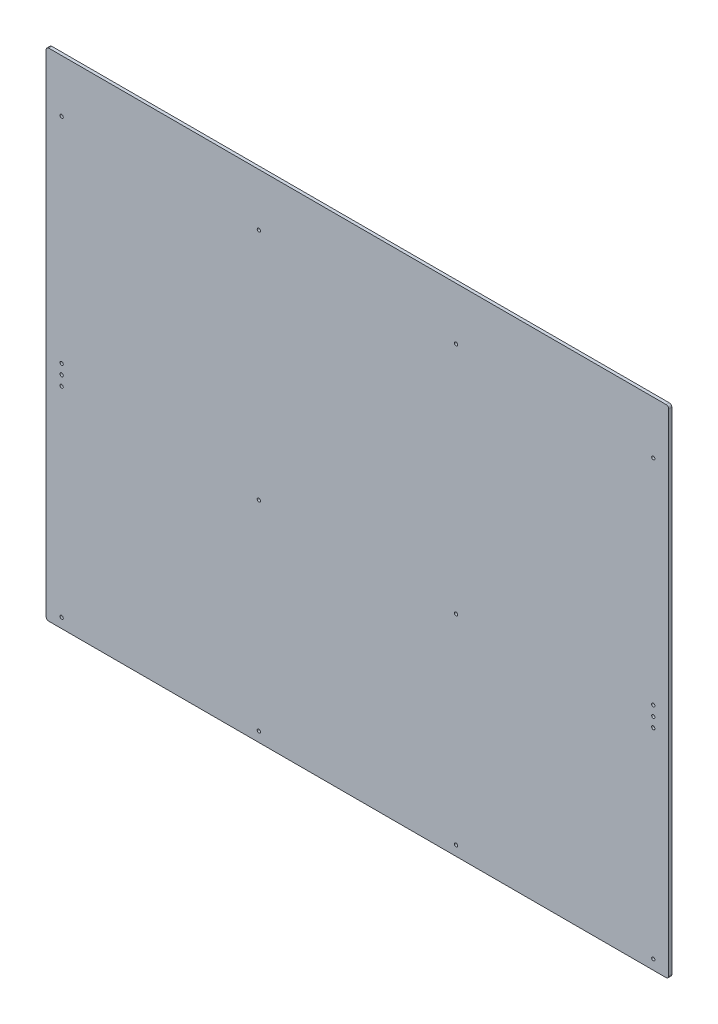
ISO-10303-21;
HEADER;
FILE_DESCRIPTION(('STEP AP214'),'2;1');
FILE_NAME('part.step','',(''),(''),'','','');
FILE_SCHEMA(('AUTOMOTIVE_DESIGN { 1 0 10303 214 1 1 1 1 }'));
ENDSEC;
DATA;
#1=APPLICATION_CONTEXT('core data for automotive mechanical design processes');
#2=APPLICATION_PROTOCOL_DEFINITION('international standard','automotive_design',2000,#1);
#3=PRODUCT_CONTEXT('',#1,'mechanical');
#4=PRODUCT('Part','Part','',(#3));
#5=PRODUCT_RELATED_PRODUCT_CATEGORY('part','',(#4));
#6=PRODUCT_DEFINITION_FORMATION('','',#4);
#7=PRODUCT_DEFINITION_CONTEXT('part definition',#1,'design');
#8=PRODUCT_DEFINITION('design','',#6,#7);
#9=PRODUCT_DEFINITION_SHAPE('','',#8);
#10=(LENGTH_UNIT() NAMED_UNIT(*) SI_UNIT(.MILLI.,.METRE.));
#11=(NAMED_UNIT(*) PLANE_ANGLE_UNIT() SI_UNIT($,.RADIAN.));
#12=(NAMED_UNIT(*) SI_UNIT($,.STERADIAN.) SOLID_ANGLE_UNIT());
#13=UNCERTAINTY_MEASURE_WITH_UNIT(LENGTH_MEASURE(1.E-05),#10,'distance_accuracy_value','');
#14=(GEOMETRIC_REPRESENTATION_CONTEXT(3) GLOBAL_UNCERTAINTY_ASSIGNED_CONTEXT((#13)) GLOBAL_UNIT_ASSIGNED_CONTEXT((#10,
#11,#12)) REPRESENTATION_CONTEXT('',''));
#15=CARTESIAN_POINT('',(0.,0.,0.));
#16=DIRECTION('',(0.,0.,1.));
#17=DIRECTION('',(1.,0.,0.));
#18=AXIS2_PLACEMENT_3D('',#15,#16,#17);
#19=CARTESIAN_POINT('',(0.,0.,3.));
#20=DIRECTION('',(0.,0.,1.));
#21=DIRECTION('',(1.,0.,0.));
#22=AXIS2_PLACEMENT_3D('',#19,#20,#21);
#23=PLANE('',#22);
#24=CARTESIAN_POINT('',(285.75,254.,3.));
#25=DIRECTION('',(0.,0.,1.));
#26=DIRECTION('',(1.,0.,0.));
#27=AXIS2_PLACEMENT_3D('',#24,#25,#26);
#28=CIRCLE('',#27,1.58750000000002);
#29=CARTESIAN_POINT('',(287.3375,254.,3.));
#30=VERTEX_POINT('',#29);
#31=EDGE_CURVE('E89',#30,#30,#28,.F.);
#32=ORIENTED_EDGE('',*,*,#31,.T.);
#33=EDGE_LOOP('',(#32));
#34=FACE_BOUND('',#33,.T.);
#35=CARTESIAN_POINT('',(285.75,-165.1,3.));
#36=DIRECTION('',(0.,0.,1.));
#37=DIRECTION('',(1.,0.,0.));
#38=AXIS2_PLACEMENT_3D('',#35,#36,#37);
#39=CIRCLE('',#38,1.58750000000002);
#40=CARTESIAN_POINT('',(287.3375,-165.1,3.));
#41=VERTEX_POINT('',#40);
#42=EDGE_CURVE('E184',#41,#41,#39,.F.);
#43=ORIENTED_EDGE('',*,*,#42,.T.);
#44=EDGE_LOOP('',(#43));
#45=FACE_BOUND('',#44,.T.);
#46=CARTESIAN_POINT('',(95.25,-165.1,3.));
#47=DIRECTION('',(0.,0.,1.));
#48=DIRECTION('',(1.,0.,0.));
#49=AXIS2_PLACEMENT_3D('',#46,#47,#48);
#50=CIRCLE('',#49,1.58749999999999);
#51=CARTESIAN_POINT('',(96.8375,-165.1,3.));
#52=VERTEX_POINT('',#51);
#53=EDGE_CURVE('E187',#52,#52,#50,.F.);
#54=ORIENTED_EDGE('',*,*,#53,.T.);
#55=EDGE_LOOP('',(#54));
#56=FACE_BOUND('',#55,.T.);
#57=CARTESIAN_POINT('',(-95.25,-165.1,3.));
#58=DIRECTION('',(0.,0.,1.));
#59=DIRECTION('',(1.,0.,0.));
#60=AXIS2_PLACEMENT_3D('',#57,#58,#59);
#61=CIRCLE('',#60,1.58749999999999);
#62=CARTESIAN_POINT('',(-93.6625,-165.1,3.));
#63=VERTEX_POINT('',#62);
#64=EDGE_CURVE('E190',#63,#63,#61,.F.);
#65=ORIENTED_EDGE('',*,*,#64,.T.);
#66=EDGE_LOOP('',(#65));
#67=FACE_BOUND('',#66,.T.);
#68=CARTESIAN_POINT('',(-285.75,-165.1,3.));
#69=DIRECTION('',(0.,0.,1.));
#70=DIRECTION('',(1.,0.,0.));
#71=AXIS2_PLACEMENT_3D('',#68,#69,#70);
#72=CIRCLE('',#71,1.58750000000002);
#73=CARTESIAN_POINT('',(-284.1625,-165.1,3.));
#74=VERTEX_POINT('',#73);
#75=EDGE_CURVE('E193',#74,#74,#72,.F.);
#76=ORIENTED_EDGE('',*,*,#75,.T.);
#77=EDGE_LOOP('',(#76));
#78=FACE_BOUND('',#77,.T.);
#79=CARTESIAN_POINT('',(95.25,254.,3.));
#80=DIRECTION('',(0.,0.,1.));
#81=DIRECTION('',(1.,0.,0.));
#82=AXIS2_PLACEMENT_3D('',#79,#80,#81);
#83=CIRCLE('',#82,1.58749999999999);
#84=CARTESIAN_POINT('',(96.8375,254.,3.));
#85=VERTEX_POINT('',#84);
#86=EDGE_CURVE('E196',#85,#85,#83,.F.);
#87=ORIENTED_EDGE('',*,*,#86,.T.);
#88=EDGE_LOOP('',(#87));
#89=FACE_BOUND('',#88,.T.);
#90=CARTESIAN_POINT('',(-95.25,254.,3.));
#91=DIRECTION('',(0.,0.,1.));
#92=DIRECTION('',(1.,0.,0.));
#93=AXIS2_PLACEMENT_3D('',#90,#91,#92);
#94=CIRCLE('',#93,1.58749999999999);
#95=CARTESIAN_POINT('',(-93.6625,254.,3.));
#96=VERTEX_POINT('',#95);
#97=EDGE_CURVE('E199',#96,#96,#94,.F.);
#98=ORIENTED_EDGE('',*,*,#97,.T.);
#99=EDGE_LOOP('',(#98));
#100=FACE_BOUND('',#99,.T.);
#101=CARTESIAN_POINT('',(-285.75,254.,3.));
#102=DIRECTION('',(0.,0.,1.));
#103=DIRECTION('',(1.,0.,0.));
#104=AXIS2_PLACEMENT_3D('',#101,#102,#103);
#105=CIRCLE('',#104,1.58750000000002);
#106=CARTESIAN_POINT('',(-284.1625,254.,3.));
#107=VERTEX_POINT('',#106);
#108=EDGE_CURVE('E202',#107,#107,#105,.F.);
#109=ORIENTED_EDGE('',*,*,#108,.T.);
#110=EDGE_LOOP('',(#109));
#111=FACE_BOUND('',#110,.T.);
#112=CARTESIAN_POINT('',(-285.75,28.2194,3.));
#113=DIRECTION('',(0.,0.,1.));
#114=DIRECTION('',(1.,0.,0.));
#115=AXIS2_PLACEMENT_3D('',#112,#113,#114);
#116=CIRCLE('',#115,1.58750000000002);
#117=CARTESIAN_POINT('',(-284.1625,28.2194,3.));
#118=VERTEX_POINT('',#117);
#119=EDGE_CURVE('E205',#118,#118,#116,.F.);
#120=ORIENTED_EDGE('',*,*,#119,.T.);
#121=EDGE_LOOP('',(#120));
#122=FACE_BOUND('',#121,.T.);
#123=CARTESIAN_POINT('',(-285.75,37.7444,3.));
#124=DIRECTION('',(0.,0.,1.));
#125=DIRECTION('',(1.,0.,0.));
#126=AXIS2_PLACEMENT_3D('',#123,#124,#125);
#127=CIRCLE('',#126,1.58750000000002);
#128=CARTESIAN_POINT('',(-284.1625,37.7444,3.));
#129=VERTEX_POINT('',#128);
#130=EDGE_CURVE('E208',#129,#129,#127,.F.);
#131=ORIENTED_EDGE('',*,*,#130,.T.);
#132=EDGE_LOOP('',(#131));
#133=FACE_BOUND('',#132,.T.);
#134=CARTESIAN_POINT('',(-285.75,47.2694,3.));
#135=DIRECTION('',(0.,0.,1.));
#136=DIRECTION('',(1.,0.,0.));
#137=AXIS2_PLACEMENT_3D('',#134,#135,#136);
#138=CIRCLE('',#137,1.58750000000002);
#139=CARTESIAN_POINT('',(-284.1625,47.2694,3.));
#140=VERTEX_POINT('',#139);
#141=EDGE_CURVE('E211',#140,#140,#138,.F.);
#142=ORIENTED_EDGE('',*,*,#141,.T.);
#143=EDGE_LOOP('',(#142));
#144=FACE_BOUND('',#143,.T.);
#145=CARTESIAN_POINT('',(-95.25,28.2194,3.));
#146=DIRECTION('',(0.,0.,1.));
#147=DIRECTION('',(1.,0.,0.));
#148=AXIS2_PLACEMENT_3D('',#145,#146,#147);
#149=CIRCLE('',#148,1.58750000000001);
#150=CARTESIAN_POINT('',(-93.6625,28.2194,3.));
#151=VERTEX_POINT('',#150);
#152=EDGE_CURVE('E214',#151,#151,#149,.F.);
#153=ORIENTED_EDGE('',*,*,#152,.T.);
#154=EDGE_LOOP('',(#153));
#155=FACE_BOUND('',#154,.T.);
#156=CARTESIAN_POINT('',(95.25,28.2194,3.));
#157=DIRECTION('',(0.,0.,1.));
#158=DIRECTION('',(1.,0.,0.));
#159=AXIS2_PLACEMENT_3D('',#156,#157,#158);
#160=CIRCLE('',#159,1.58750000000001);
#161=CARTESIAN_POINT('',(96.8375,28.2194,3.));
#162=VERTEX_POINT('',#161);
#163=EDGE_CURVE('E217',#162,#162,#160,.F.);
#164=ORIENTED_EDGE('',*,*,#163,.T.);
#165=EDGE_LOOP('',(#164));
#166=FACE_BOUND('',#165,.T.);
#167=CARTESIAN_POINT('',(285.75,28.2194,3.));
#168=DIRECTION('',(0.,0.,1.));
#169=DIRECTION('',(1.,0.,0.));
#170=AXIS2_PLACEMENT_3D('',#167,#168,#169);
#171=CIRCLE('',#170,1.58750000000002);
#172=CARTESIAN_POINT('',(287.3375,28.2194,3.));
#173=VERTEX_POINT('',#172);
#174=EDGE_CURVE('E220',#173,#173,#171,.F.);
#175=ORIENTED_EDGE('',*,*,#174,.T.);
#176=EDGE_LOOP('',(#175));
#177=FACE_BOUND('',#176,.T.);
#178=CARTESIAN_POINT('',(285.75,37.7444,3.));
#179=DIRECTION('',(0.,0.,1.));
#180=DIRECTION('',(1.,0.,0.));
#181=AXIS2_PLACEMENT_3D('',#178,#179,#180);
#182=CIRCLE('',#181,1.58749999999996);
#183=CARTESIAN_POINT('',(287.3375,37.7444,3.));
#184=VERTEX_POINT('',#183);
#185=EDGE_CURVE('E222',#184,#184,#182,.F.);
#186=ORIENTED_EDGE('',*,*,#185,.T.);
#187=EDGE_LOOP('',(#186));
#188=FACE_BOUND('',#187,.T.);
#189=CARTESIAN_POINT('',(285.75,47.2694,3.));
#190=DIRECTION('',(0.,0.,1.));
#191=DIRECTION('',(1.,0.,0.));
#192=AXIS2_PLACEMENT_3D('',#189,#190,#191);
#193=CIRCLE('',#192,1.58749999999996);
#194=CARTESIAN_POINT('',(287.3375,47.2694,3.));
#195=VERTEX_POINT('',#194);
#196=EDGE_CURVE('E19',#195,#195,#193,.F.);
#197=ORIENTED_EDGE('',*,*,#196,.T.);
#198=EDGE_LOOP('',(#197));
#199=FACE_BOUND('',#198,.T.);
#200=CARTESIAN_POINT('',(-298.1325,302.26,3.));
#201=DIRECTION('',(0.,0.,-1.));
#202=DIRECTION('',(-1.,0.,0.));
#203=AXIS2_PLACEMENT_3D('',#200,#201,#202);
#204=CIRCLE('',#203,2.53999999999999);
#205=CARTESIAN_POINT('',(-300.6725,302.26,3.));
#206=VERTEX_POINT('',#205);
#207=CARTESIAN_POINT('',(-298.1325,304.8,3.));
#208=VERTEX_POINT('',#207);
#209=EDGE_CURVE('E114',#206,#208,#204,.T.);
#210=ORIENTED_EDGE('',*,*,#209,.F.);
#211=DIRECTION('',(0.,1.,0.));
#212=VECTOR('',#211,1.);
#213=CARTESIAN_POINT('',(-300.6725,-304.8,3.));
#214=LINE('',#213,#212);
#215=CARTESIAN_POINT('',(-300.6725,-172.085,2.99999999999992));
#216=VERTEX_POINT('',#215);
#217=EDGE_CURVE('E107',#206,#216,#214,.F.);
#218=ORIENTED_EDGE('',*,*,#217,.T.);
#219=CARTESIAN_POINT('',(-298.1325,-172.085,2.99999999999989));
#220=DIRECTION('',(0.,0.,-1.));
#221=DIRECTION('',(-1.,0.,0.));
#222=AXIS2_PLACEMENT_3D('',#219,#220,#221);
#223=CIRCLE('',#222,2.53999999999999);
#224=CARTESIAN_POINT('',(-298.1325,-174.625,2.99999999999989));
#225=VERTEX_POINT('',#224);
#226=EDGE_CURVE('E110',#225,#216,#223,.T.);
#227=ORIENTED_EDGE('',*,*,#226,.F.);
#228=DIRECTION('',(1.,0.,0.));
#229=VECTOR('',#228,1.);
#230=CARTESIAN_POINT('',(-298.1325,-174.625,2.99999999999989));
#231=LINE('',#230,#229);
#232=CARTESIAN_POINT('',(298.1325,-174.625,2.99999999999989));
#233=VERTEX_POINT('',#232);
#234=EDGE_CURVE('E83',#225,#233,#231,.T.);
#235=ORIENTED_EDGE('',*,*,#234,.T.);
#236=CARTESIAN_POINT('',(298.1325,-172.085,2.99999999999989));
#237=DIRECTION('',(0.,0.,-1.));
#238=DIRECTION('',(-1.,0.,0.));
#239=AXIS2_PLACEMENT_3D('',#236,#237,#238);
#240=CIRCLE('',#239,2.53999999999999);
#241=CARTESIAN_POINT('',(300.6725,-172.085,2.99999999999989));
#242=VERTEX_POINT('',#241);
#243=EDGE_CURVE('E79',#242,#233,#240,.T.);
#244=ORIENTED_EDGE('',*,*,#243,.F.);
#245=DIRECTION('',(0.,1.,0.));
#246=VECTOR('',#245,1.);
#247=CARTESIAN_POINT('',(300.6725,-304.8,2.99999999999989));
#248=LINE('',#247,#246);
#249=CARTESIAN_POINT('',(300.6725,302.26,2.99999999999995));
#250=VERTEX_POINT('',#249);
#251=EDGE_CURVE('E81',#242,#250,#248,.T.);
#252=ORIENTED_EDGE('',*,*,#251,.T.);
#253=CARTESIAN_POINT('',(298.1325,302.26,3.));
#254=DIRECTION('',(0.,0.,-1.));
#255=DIRECTION('',(-1.,0.,0.));
#256=AXIS2_PLACEMENT_3D('',#253,#254,#255);
#257=CIRCLE('',#256,2.53999999999999);
#258=CARTESIAN_POINT('',(298.1325,304.8,3.));
#259=VERTEX_POINT('',#258);
#260=EDGE_CURVE('E96',#259,#250,#257,.T.);
#261=ORIENTED_EDGE('',*,*,#260,.F.);
#262=DIRECTION('',(1.,0.,0.));
#263=VECTOR('',#262,1.);
#264=CARTESIAN_POINT('',(300.6725,304.8,3.));
#265=LINE('',#264,#263);
#266=EDGE_CURVE('E112',#259,#208,#265,.F.);
#267=ORIENTED_EDGE('',*,*,#266,.T.);
#268=EDGE_LOOP('',(#210,#218,#227,#235,#244,#252,#261,#267));
#269=FACE_BOUND('',#268,.T.);
#270=ADVANCED_FACE('F16',(#34,#45,#56,#67,#78,#89,#100,#111,#122,#133,#144,#155,#166,#177,#188,
#199,#269),#23,.T.);
#271=CARTESIAN_POINT('',(285.75,47.2694,0.));
#272=DIRECTION('',(0.,0.,1.));
#273=DIRECTION('',(1.,0.,0.));
#274=AXIS2_PLACEMENT_3D('',#271,#272,#273);
#275=CYLINDRICAL_SURFACE('',#274,1.58749999999996);
#276=CARTESIAN_POINT('',(285.75,47.2694,0.));
#277=DIRECTION('',(0.,0.,1.));
#278=DIRECTION('',(1.,0.,0.));
#279=AXIS2_PLACEMENT_3D('',#276,#277,#278);
#280=CIRCLE('',#279,1.58749999999996);
#281=CARTESIAN_POINT('',(287.3375,47.2694,0.));
#282=VERTEX_POINT('',#281);
#283=EDGE_CURVE('E174',#282,#282,#280,.F.);
#284=ORIENTED_EDGE('',*,*,#283,.T.);
#285=EDGE_LOOP('',(#284));
#286=FACE_BOUND('',#285,.T.);
#287=ORIENTED_EDGE('',*,*,#196,.F.);
#288=EDGE_LOOP('',(#287));
#289=FACE_BOUND('',#288,.T.);
#290=ADVANCED_FACE('F230',(#286,#289),#275,.F.);
#291=CARTESIAN_POINT('',(285.75,37.7444,0.));
#292=DIRECTION('',(0.,0.,1.));
#293=DIRECTION('',(1.,0.,0.));
#294=AXIS2_PLACEMENT_3D('',#291,#292,#293);
#295=CYLINDRICAL_SURFACE('',#294,1.58749999999996);
#296=CARTESIAN_POINT('',(285.75,37.7444,0.));
#297=DIRECTION('',(0.,0.,1.));
#298=DIRECTION('',(1.,0.,0.));
#299=AXIS2_PLACEMENT_3D('',#296,#297,#298);
#300=CIRCLE('',#299,1.58749999999996);
#301=CARTESIAN_POINT('',(287.3375,37.7444,0.));
#302=VERTEX_POINT('',#301);
#303=EDGE_CURVE('E171',#302,#302,#300,.F.);
#304=ORIENTED_EDGE('',*,*,#303,.T.);
#305=EDGE_LOOP('',(#304));
#306=FACE_BOUND('',#305,.T.);
#307=ORIENTED_EDGE('',*,*,#185,.F.);
#308=EDGE_LOOP('',(#307));
#309=FACE_BOUND('',#308,.T.);
#310=ADVANCED_FACE('F232',(#306,#309),#295,.F.);
#311=CARTESIAN_POINT('',(285.75,28.2194,0.));
#312=DIRECTION('',(0.,0.,1.));
#313=DIRECTION('',(1.,0.,0.));
#314=AXIS2_PLACEMENT_3D('',#311,#312,#313);
#315=CYLINDRICAL_SURFACE('',#314,1.58750000000002);
#316=CARTESIAN_POINT('',(285.75,28.2194,0.));
#317=DIRECTION('',(0.,0.,1.));
#318=DIRECTION('',(1.,0.,0.));
#319=AXIS2_PLACEMENT_3D('',#316,#317,#318);
#320=CIRCLE('',#319,1.58750000000002);
#321=CARTESIAN_POINT('',(287.3375,28.2194,0.));
#322=VERTEX_POINT('',#321);
#323=EDGE_CURVE('E168',#322,#322,#320,.F.);
#324=ORIENTED_EDGE('',*,*,#323,.T.);
#325=EDGE_LOOP('',(#324));
#326=FACE_BOUND('',#325,.T.);
#327=ORIENTED_EDGE('',*,*,#174,.F.);
#328=EDGE_LOOP('',(#327));
#329=FACE_BOUND('',#328,.T.);
#330=ADVANCED_FACE('F239',(#326,#329),#315,.F.);
#331=CARTESIAN_POINT('',(95.25,28.2194,0.));
#332=DIRECTION('',(0.,0.,1.));
#333=DIRECTION('',(1.,0.,0.));
#334=AXIS2_PLACEMENT_3D('',#331,#332,#333);
#335=CYLINDRICAL_SURFACE('',#334,1.58750000000001);
#336=CARTESIAN_POINT('',(95.25,28.2194,0.));
#337=DIRECTION('',(0.,0.,1.));
#338=DIRECTION('',(1.,0.,0.));
#339=AXIS2_PLACEMENT_3D('',#336,#337,#338);
#340=CIRCLE('',#339,1.58750000000001);
#341=CARTESIAN_POINT('',(96.8375,28.2194,0.));
#342=VERTEX_POINT('',#341);
#343=EDGE_CURVE('E165',#342,#342,#340,.F.);
#344=ORIENTED_EDGE('',*,*,#343,.T.);
#345=EDGE_LOOP('',(#344));
#346=FACE_BOUND('',#345,.T.);
#347=ORIENTED_EDGE('',*,*,#163,.F.);
#348=EDGE_LOOP('',(#347));
#349=FACE_BOUND('',#348,.T.);
#350=ADVANCED_FACE('F327',(#346,#349),#335,.F.);
#351=CARTESIAN_POINT('',(-95.25,28.2194,0.));
#352=DIRECTION('',(0.,0.,1.));
#353=DIRECTION('',(1.,0.,0.));
#354=AXIS2_PLACEMENT_3D('',#351,#352,#353);
#355=CYLINDRICAL_SURFACE('',#354,1.58750000000001);
#356=CARTESIAN_POINT('',(-95.25,28.2194,0.));
#357=DIRECTION('',(0.,0.,1.));
#358=DIRECTION('',(1.,0.,0.));
#359=AXIS2_PLACEMENT_3D('',#356,#357,#358);
#360=CIRCLE('',#359,1.58750000000001);
#361=CARTESIAN_POINT('',(-93.6625,28.2194,0.));
#362=VERTEX_POINT('',#361);
#363=EDGE_CURVE('E162',#362,#362,#360,.F.);
#364=ORIENTED_EDGE('',*,*,#363,.T.);
#365=EDGE_LOOP('',(#364));
#366=FACE_BOUND('',#365,.T.);
#367=ORIENTED_EDGE('',*,*,#152,.F.);
#368=EDGE_LOOP('',(#367));
#369=FACE_BOUND('',#368,.T.);
#370=ADVANCED_FACE('F323',(#366,#369),#355,.F.);
#371=CARTESIAN_POINT('',(-285.75,47.2694,0.));
#372=DIRECTION('',(0.,0.,1.));
#373=DIRECTION('',(1.,0.,0.));
#374=AXIS2_PLACEMENT_3D('',#371,#372,#373);
#375=CYLINDRICAL_SURFACE('',#374,1.58750000000002);
#376=CARTESIAN_POINT('',(-285.75,47.2694,0.));
#377=DIRECTION('',(0.,0.,1.));
#378=DIRECTION('',(1.,0.,0.));
#379=AXIS2_PLACEMENT_3D('',#376,#377,#378);
#380=CIRCLE('',#379,1.58750000000002);
#381=CARTESIAN_POINT('',(-284.1625,47.2694,0.));
#382=VERTEX_POINT('',#381);
#383=EDGE_CURVE('E159',#382,#382,#380,.F.);
#384=ORIENTED_EDGE('',*,*,#383,.T.);
#385=EDGE_LOOP('',(#384));
#386=FACE_BOUND('',#385,.T.);
#387=ORIENTED_EDGE('',*,*,#141,.F.);
#388=EDGE_LOOP('',(#387));
#389=FACE_BOUND('',#388,.T.);
#390=ADVANCED_FACE('F319',(#386,#389),#375,.F.);
#391=CARTESIAN_POINT('',(-285.75,37.7444,0.));
#392=DIRECTION('',(0.,0.,1.));
#393=DIRECTION('',(1.,0.,0.));
#394=AXIS2_PLACEMENT_3D('',#391,#392,#393);
#395=CYLINDRICAL_SURFACE('',#394,1.58750000000002);
#396=CARTESIAN_POINT('',(-285.75,37.7444,0.));
#397=DIRECTION('',(0.,0.,1.));
#398=DIRECTION('',(1.,0.,0.));
#399=AXIS2_PLACEMENT_3D('',#396,#397,#398);
#400=CIRCLE('',#399,1.58750000000002);
#401=CARTESIAN_POINT('',(-284.1625,37.7444,0.));
#402=VERTEX_POINT('',#401);
#403=EDGE_CURVE('E156',#402,#402,#400,.F.);
#404=ORIENTED_EDGE('',*,*,#403,.T.);
#405=EDGE_LOOP('',(#404));
#406=FACE_BOUND('',#405,.T.);
#407=ORIENTED_EDGE('',*,*,#130,.F.);
#408=EDGE_LOOP('',(#407));
#409=FACE_BOUND('',#408,.T.);
#410=ADVANCED_FACE('F315',(#406,#409),#395,.F.);
#411=CARTESIAN_POINT('',(-285.75,28.2194,0.));
#412=DIRECTION('',(0.,0.,1.));
#413=DIRECTION('',(1.,0.,0.));
#414=AXIS2_PLACEMENT_3D('',#411,#412,#413);
#415=CYLINDRICAL_SURFACE('',#414,1.58750000000002);
#416=CARTESIAN_POINT('',(-285.75,28.2194,0.));
#417=DIRECTION('',(0.,0.,1.));
#418=DIRECTION('',(1.,0.,0.));
#419=AXIS2_PLACEMENT_3D('',#416,#417,#418);
#420=CIRCLE('',#419,1.58750000000002);
#421=CARTESIAN_POINT('',(-284.1625,28.2194,0.));
#422=VERTEX_POINT('',#421);
#423=EDGE_CURVE('E153',#422,#422,#420,.F.);
#424=ORIENTED_EDGE('',*,*,#423,.T.);
#425=EDGE_LOOP('',(#424));
#426=FACE_BOUND('',#425,.T.);
#427=ORIENTED_EDGE('',*,*,#119,.F.);
#428=EDGE_LOOP('',(#427));
#429=FACE_BOUND('',#428,.T.);
#430=ADVANCED_FACE('F311',(#426,#429),#415,.F.);
#431=CARTESIAN_POINT('',(-285.75,254.,0.));
#432=DIRECTION('',(0.,0.,1.));
#433=DIRECTION('',(1.,0.,0.));
#434=AXIS2_PLACEMENT_3D('',#431,#432,#433);
#435=CYLINDRICAL_SURFACE('',#434,1.58750000000002);
#436=CARTESIAN_POINT('',(-285.75,254.,0.));
#437=DIRECTION('',(0.,0.,1.));
#438=DIRECTION('',(1.,0.,0.));
#439=AXIS2_PLACEMENT_3D('',#436,#437,#438);
#440=CIRCLE('',#439,1.58750000000002);
#441=CARTESIAN_POINT('',(-284.1625,254.,0.));
#442=VERTEX_POINT('',#441);
#443=EDGE_CURVE('E150',#442,#442,#440,.F.);
#444=ORIENTED_EDGE('',*,*,#443,.T.);
#445=EDGE_LOOP('',(#444));
#446=FACE_BOUND('',#445,.T.);
#447=ORIENTED_EDGE('',*,*,#108,.F.);
#448=EDGE_LOOP('',(#447));
#449=FACE_BOUND('',#448,.T.);
#450=ADVANCED_FACE('F307',(#446,#449),#435,.F.);
#451=CARTESIAN_POINT('',(-95.25,254.,0.));
#452=DIRECTION('',(0.,0.,1.));
#453=DIRECTION('',(1.,0.,0.));
#454=AXIS2_PLACEMENT_3D('',#451,#452,#453);
#455=CYLINDRICAL_SURFACE('',#454,1.58749999999999);
#456=CARTESIAN_POINT('',(-95.25,254.,0.));
#457=DIRECTION('',(0.,0.,1.));
#458=DIRECTION('',(1.,0.,0.));
#459=AXIS2_PLACEMENT_3D('',#456,#457,#458);
#460=CIRCLE('',#459,1.58749999999999);
#461=CARTESIAN_POINT('',(-93.6625,254.,0.));
#462=VERTEX_POINT('',#461);
#463=EDGE_CURVE('E147',#462,#462,#460,.F.);
#464=ORIENTED_EDGE('',*,*,#463,.T.);
#465=EDGE_LOOP('',(#464));
#466=FACE_BOUND('',#465,.T.);
#467=ORIENTED_EDGE('',*,*,#97,.F.);
#468=EDGE_LOOP('',(#467));
#469=FACE_BOUND('',#468,.T.);
#470=ADVANCED_FACE('F303',(#466,#469),#455,.F.);
#471=CARTESIAN_POINT('',(95.25,254.,0.));
#472=DIRECTION('',(0.,0.,1.));
#473=DIRECTION('',(1.,0.,0.));
#474=AXIS2_PLACEMENT_3D('',#471,#472,#473);
#475=CYLINDRICAL_SURFACE('',#474,1.58749999999999);
#476=CARTESIAN_POINT('',(95.25,254.,0.));
#477=DIRECTION('',(0.,0.,1.));
#478=DIRECTION('',(1.,0.,0.));
#479=AXIS2_PLACEMENT_3D('',#476,#477,#478);
#480=CIRCLE('',#479,1.58749999999999);
#481=CARTESIAN_POINT('',(96.8375,254.,0.));
#482=VERTEX_POINT('',#481);
#483=EDGE_CURVE('E144',#482,#482,#480,.F.);
#484=ORIENTED_EDGE('',*,*,#483,.T.);
#485=EDGE_LOOP('',(#484));
#486=FACE_BOUND('',#485,.T.);
#487=ORIENTED_EDGE('',*,*,#86,.F.);
#488=EDGE_LOOP('',(#487));
#489=FACE_BOUND('',#488,.T.);
#490=ADVANCED_FACE('F299',(#486,#489),#475,.F.);
#491=CARTESIAN_POINT('',(-285.75,-165.1,0.));
#492=DIRECTION('',(0.,0.,1.));
#493=DIRECTION('',(1.,0.,0.));
#494=AXIS2_PLACEMENT_3D('',#491,#492,#493);
#495=CYLINDRICAL_SURFACE('',#494,1.58750000000002);
#496=CARTESIAN_POINT('',(-285.75,-165.1,0.));
#497=DIRECTION('',(0.,0.,1.));
#498=DIRECTION('',(1.,0.,0.));
#499=AXIS2_PLACEMENT_3D('',#496,#497,#498);
#500=CIRCLE('',#499,1.58750000000002);
#501=CARTESIAN_POINT('',(-284.1625,-165.1,0.));
#502=VERTEX_POINT('',#501);
#503=EDGE_CURVE('E141',#502,#502,#500,.F.);
#504=ORIENTED_EDGE('',*,*,#503,.T.);
#505=EDGE_LOOP('',(#504));
#506=FACE_BOUND('',#505,.T.);
#507=ORIENTED_EDGE('',*,*,#75,.F.);
#508=EDGE_LOOP('',(#507));
#509=FACE_BOUND('',#508,.T.);
#510=ADVANCED_FACE('F295',(#506,#509),#495,.F.);
#511=CARTESIAN_POINT('',(-95.25,-165.1,0.));
#512=DIRECTION('',(0.,0.,1.));
#513=DIRECTION('',(1.,0.,0.));
#514=AXIS2_PLACEMENT_3D('',#511,#512,#513);
#515=CYLINDRICAL_SURFACE('',#514,1.58749999999999);
#516=CARTESIAN_POINT('',(-95.25,-165.1,0.));
#517=DIRECTION('',(0.,0.,1.));
#518=DIRECTION('',(1.,0.,0.));
#519=AXIS2_PLACEMENT_3D('',#516,#517,#518);
#520=CIRCLE('',#519,1.58749999999999);
#521=CARTESIAN_POINT('',(-93.6625,-165.1,0.));
#522=VERTEX_POINT('',#521);
#523=EDGE_CURVE('E138',#522,#522,#520,.F.);
#524=ORIENTED_EDGE('',*,*,#523,.T.);
#525=EDGE_LOOP('',(#524));
#526=FACE_BOUND('',#525,.T.);
#527=ORIENTED_EDGE('',*,*,#64,.F.);
#528=EDGE_LOOP('',(#527));
#529=FACE_BOUND('',#528,.T.);
#530=ADVANCED_FACE('F291',(#526,#529),#515,.F.);
#531=CARTESIAN_POINT('',(95.25,-165.1,0.));
#532=DIRECTION('',(0.,0.,1.));
#533=DIRECTION('',(1.,0.,0.));
#534=AXIS2_PLACEMENT_3D('',#531,#532,#533);
#535=CYLINDRICAL_SURFACE('',#534,1.58749999999999);
#536=CARTESIAN_POINT('',(95.25,-165.1,0.));
#537=DIRECTION('',(0.,0.,1.));
#538=DIRECTION('',(1.,0.,0.));
#539=AXIS2_PLACEMENT_3D('',#536,#537,#538);
#540=CIRCLE('',#539,1.58749999999999);
#541=CARTESIAN_POINT('',(96.8375,-165.1,0.));
#542=VERTEX_POINT('',#541);
#543=EDGE_CURVE('E135',#542,#542,#540,.F.);
#544=ORIENTED_EDGE('',*,*,#543,.T.);
#545=EDGE_LOOP('',(#544));
#546=FACE_BOUND('',#545,.T.);
#547=ORIENTED_EDGE('',*,*,#53,.F.);
#548=EDGE_LOOP('',(#547));
#549=FACE_BOUND('',#548,.T.);
#550=ADVANCED_FACE('F287',(#546,#549),#535,.F.);
#551=CARTESIAN_POINT('',(285.75,-165.1,0.));
#552=DIRECTION('',(0.,0.,1.));
#553=DIRECTION('',(1.,0.,0.));
#554=AXIS2_PLACEMENT_3D('',#551,#552,#553);
#555=CYLINDRICAL_SURFACE('',#554,1.58750000000002);
#556=CARTESIAN_POINT('',(285.75,-165.1,0.));
#557=DIRECTION('',(0.,0.,1.));
#558=DIRECTION('',(1.,0.,0.));
#559=AXIS2_PLACEMENT_3D('',#556,#557,#558);
#560=CIRCLE('',#559,1.58750000000002);
#561=CARTESIAN_POINT('',(287.3375,-165.1,0.));
#562=VERTEX_POINT('',#561);
#563=EDGE_CURVE('E132',#562,#562,#560,.F.);
#564=ORIENTED_EDGE('',*,*,#563,.T.);
#565=EDGE_LOOP('',(#564));
#566=FACE_BOUND('',#565,.T.);
#567=ORIENTED_EDGE('',*,*,#42,.F.);
#568=EDGE_LOOP('',(#567));
#569=FACE_BOUND('',#568,.T.);
#570=ADVANCED_FACE('F283',(#566,#569),#555,.F.);
#571=CARTESIAN_POINT('',(285.75,254.,0.));
#572=DIRECTION('',(0.,0.,1.));
#573=DIRECTION('',(1.,0.,0.));
#574=AXIS2_PLACEMENT_3D('',#571,#572,#573);
#575=CYLINDRICAL_SURFACE('',#574,1.58750000000002);
#576=CARTESIAN_POINT('',(285.75,254.,0.));
#577=DIRECTION('',(0.,0.,1.));
#578=DIRECTION('',(1.,0.,0.));
#579=AXIS2_PLACEMENT_3D('',#576,#577,#578);
#580=CIRCLE('',#579,1.58750000000002);
#581=CARTESIAN_POINT('',(287.3375,254.,0.));
#582=VERTEX_POINT('',#581);
#583=EDGE_CURVE('E129',#582,#582,#580,.F.);
#584=ORIENTED_EDGE('',*,*,#583,.T.);
#585=EDGE_LOOP('',(#584));
#586=FACE_BOUND('',#585,.T.);
#587=ORIENTED_EDGE('',*,*,#31,.F.);
#588=EDGE_LOOP('',(#587));
#589=FACE_BOUND('',#588,.T.);
#590=ADVANCED_FACE('F280',(#586,#589),#575,.F.);
#591=CARTESIAN_POINT('',(298.1325,-172.085,1073.3657151187));
#592=DIRECTION('',(0.,0.,-1.));
#593=DIRECTION('',(-1.,0.,0.));
#594=AXIS2_PLACEMENT_3D('',#591,#592,#593);
#595=CYLINDRICAL_SURFACE('',#594,2.53999999999999);
#596=DIRECTION('',(0.,0.,1.));
#597=VECTOR('',#596,1.);
#598=CARTESIAN_POINT('',(298.1325,-174.625,1073.3657151187));
#599=LINE('',#598,#597);
#600=CARTESIAN_POINT('',(298.1325,-174.625,0.));
#601=VERTEX_POINT('',#600);
#602=EDGE_CURVE('E106',#233,#601,#599,.F.);
#603=ORIENTED_EDGE('',*,*,#602,.T.);
#604=CARTESIAN_POINT('',(298.1325,-172.085,0.));
#605=DIRECTION('',(0.,0.,-1.));
#606=DIRECTION('',(-1.,0.,0.));
#607=AXIS2_PLACEMENT_3D('',#604,#605,#606);
#608=CIRCLE('',#607,2.53999999999999);
#609=CARTESIAN_POINT('',(300.6725,-172.085,0.));
#610=VERTEX_POINT('',#609);
#611=EDGE_CURVE('E100',#601,#610,#608,.F.);
#612=ORIENTED_EDGE('',*,*,#611,.T.);
#613=DIRECTION('',(0.,0.,1.));
#614=VECTOR('',#613,1.);
#615=CARTESIAN_POINT('',(300.6725,-172.085,3.));
#616=LINE('',#615,#614);
#617=EDGE_CURVE('E88',#610,#242,#616,.T.);
#618=ORIENTED_EDGE('',*,*,#617,.T.);
#619=ORIENTED_EDGE('',*,*,#243,.T.);
#620=EDGE_LOOP('',(#603,#612,#618,#619));
#621=FACE_BOUND('',#620,.T.);
#622=ADVANCED_FACE('F99',(#621),#595,.T.);
#623=CARTESIAN_POINT('',(300.6725,-304.8,3.));
#624=DIRECTION('',(-1.,0.,0.));
#625=DIRECTION('',(0.,0.,1.));
#626=AXIS2_PLACEMENT_3D('',#623,#624,#625);
#627=PLANE('',#626);
#628=ORIENTED_EDGE('',*,*,#617,.F.);
#629=DIRECTION('',(0.,1.,0.));
#630=VECTOR('',#629,1.);
#631=CARTESIAN_POINT('',(300.6725,0.,0.));
#632=LINE('',#631,#630);
#633=CARTESIAN_POINT('',(300.6725,302.26,0.));
#634=VERTEX_POINT('',#633);
#635=EDGE_CURVE('E127',#610,#634,#632,.T.);
#636=ORIENTED_EDGE('',*,*,#635,.T.);
#637=DIRECTION('',(0.,0.,-1.));
#638=VECTOR('',#637,1.);
#639=CARTESIAN_POINT('',(300.6725,302.26,3.));
#640=LINE('',#639,#638);
#641=EDGE_CURVE('E95',#250,#634,#640,.T.);
#642=ORIENTED_EDGE('',*,*,#641,.F.);
#643=ORIENTED_EDGE('',*,*,#251,.F.);
#644=EDGE_LOOP('',(#628,#636,#642,#643));
#645=FACE_BOUND('',#644,.T.);
#646=ADVANCED_FACE('F92',(#645),#627,.F.);
#647=CARTESIAN_POINT('',(298.1325,302.26,3.));
#648=DIRECTION('',(0.,0.,-1.));
#649=DIRECTION('',(-1.,0.,0.));
#650=AXIS2_PLACEMENT_3D('',#647,#648,#649);
#651=CYLINDRICAL_SURFACE('',#650,2.53999999999999);
#652=CARTESIAN_POINT('',(298.1325,302.26,0.));
#653=DIRECTION('',(0.,0.,-1.));
#654=DIRECTION('',(-1.,0.,0.));
#655=AXIS2_PLACEMENT_3D('',#652,#653,#654);
#656=CIRCLE('',#655,2.53999999999999);
#657=CARTESIAN_POINT('',(298.1325,304.8,0.));
#658=VERTEX_POINT('',#657);
#659=EDGE_CURVE('E124',#634,#658,#656,.F.);
#660=ORIENTED_EDGE('',*,*,#659,.T.);
#661=DIRECTION('',(0.,0.,1.));
#662=VECTOR('',#661,1.);
#663=CARTESIAN_POINT('',(298.1325,304.8,3.));
#664=LINE('',#663,#662);
#665=EDGE_CURVE('E115',#658,#259,#664,.T.);
#666=ORIENTED_EDGE('',*,*,#665,.T.);
#667=ORIENTED_EDGE('',*,*,#260,.T.);
#668=ORIENTED_EDGE('',*,*,#641,.T.);
#669=EDGE_LOOP('',(#660,#666,#667,#668));
#670=FACE_BOUND('',#669,.T.);
#671=ADVANCED_FACE('F271',(#670),#651,.T.);
#672=CARTESIAN_POINT('',(300.6725,304.8,3.));
#673=DIRECTION('',(0.,-1.,0.));
#674=DIRECTION('',(1.,0.,0.));
#675=AXIS2_PLACEMENT_3D('',#672,#673,#674);
#676=PLANE('',#675);
#677=DIRECTION('',(0.,0.,-1.));
#678=VECTOR('',#677,1.);
#679=CARTESIAN_POINT('',(-298.1325,304.8,3.));
#680=LINE('',#679,#678);
#681=CARTESIAN_POINT('',(-298.1325,304.8,0.));
#682=VERTEX_POINT('',#681);
#683=EDGE_CURVE('E180',#208,#682,#680,.T.);
#684=ORIENTED_EDGE('',*,*,#683,.F.);
#685=ORIENTED_EDGE('',*,*,#266,.F.);
#686=ORIENTED_EDGE('',*,*,#665,.F.);
#687=DIRECTION('',(1.,0.,0.));
#688=VECTOR('',#687,1.);
#689=CARTESIAN_POINT('',(0.,304.8,0.));
#690=LINE('',#689,#688);
#691=EDGE_CURVE('E123',#658,#682,#690,.F.);
#692=ORIENTED_EDGE('',*,*,#691,.T.);
#693=EDGE_LOOP('',(#684,#685,#686,#692));
#694=FACE_BOUND('',#693,.T.);
#695=ADVANCED_FACE('F267',(#694),#676,.F.);
#696=CARTESIAN_POINT('',(-298.1325,302.26,3.));
#697=DIRECTION('',(0.,0.,-1.));
#698=DIRECTION('',(-1.,0.,0.));
#699=AXIS2_PLACEMENT_3D('',#696,#697,#698);
#700=CYLINDRICAL_SURFACE('',#699,2.53999999999999);
#701=CARTESIAN_POINT('',(-298.1325,302.26,0.));
#702=DIRECTION('',(0.,0.,-1.));
#703=DIRECTION('',(-1.,0.,0.));
#704=AXIS2_PLACEMENT_3D('',#701,#702,#703);
#705=CIRCLE('',#704,2.53999999999999);
#706=CARTESIAN_POINT('',(-300.6725,302.26,0.));
#707=VERTEX_POINT('',#706);
#708=EDGE_CURVE('E120',#682,#707,#705,.F.);
#709=ORIENTED_EDGE('',*,*,#708,.T.);
#710=DIRECTION('',(0.,0.,-1.));
#711=VECTOR('',#710,1.);
#712=CARTESIAN_POINT('',(-300.6725,302.26,3.));
#713=LINE('',#712,#711);
#714=EDGE_CURVE('E111',#707,#206,#713,.F.);
#715=ORIENTED_EDGE('',*,*,#714,.T.);
#716=ORIENTED_EDGE('',*,*,#209,.T.);
#717=ORIENTED_EDGE('',*,*,#683,.T.);
#718=EDGE_LOOP('',(#709,#715,#716,#717));
#719=FACE_BOUND('',#718,.T.);
#720=ADVANCED_FACE('F263',(#719),#700,.T.);
#721=CARTESIAN_POINT('',(-300.6725,-304.8,3.));
#722=DIRECTION('',(1.,0.,0.));
#723=DIRECTION('',(0.,0.,-1.));
#724=AXIS2_PLACEMENT_3D('',#721,#722,#723);
#725=PLANE('',#724);
#726=DIRECTION('',(0.,0.,-1.));
#727=VECTOR('',#726,1.);
#728=CARTESIAN_POINT('',(-300.6725,-172.085,1073.3657151187));
#729=LINE('',#728,#727);
#730=CARTESIAN_POINT('',(-300.6725,-172.085,0.));
#731=VERTEX_POINT('',#730);
#732=EDGE_CURVE('E178',#216,#731,#729,.T.);
#733=ORIENTED_EDGE('',*,*,#732,.F.);
#734=ORIENTED_EDGE('',*,*,#217,.F.);
#735=ORIENTED_EDGE('',*,*,#714,.F.);
#736=DIRECTION('',(0.,1.,0.));
#737=VECTOR('',#736,1.);
#738=CARTESIAN_POINT('',(-300.6725,0.,0.));
#739=LINE('',#738,#737);
#740=EDGE_CURVE('E119',#707,#731,#739,.F.);
#741=ORIENTED_EDGE('',*,*,#740,.T.);
#742=EDGE_LOOP('',(#733,#734,#735,#741));
#743=FACE_BOUND('',#742,.T.);
#744=ADVANCED_FACE('F259',(#743),#725,.F.);
#745=CARTESIAN_POINT('',(-298.1325,-172.085,1073.3657151187));
#746=DIRECTION('',(0.,0.,-1.));
#747=DIRECTION('',(-1.,0.,0.));
#748=AXIS2_PLACEMENT_3D('',#745,#746,#747);
#749=CYLINDRICAL_SURFACE('',#748,2.53999999999999);
#750=ORIENTED_EDGE('',*,*,#732,.T.);
#751=CARTESIAN_POINT('',(-298.1325,-172.085,0.));
#752=DIRECTION('',(0.,0.,-1.));
#753=DIRECTION('',(-1.,0.,0.));
#754=AXIS2_PLACEMENT_3D('',#751,#752,#753);
#755=CIRCLE('',#754,2.53999999999999);
#756=CARTESIAN_POINT('',(-298.1325,-174.625,0.));
#757=VERTEX_POINT('',#756);
#758=EDGE_CURVE('E25',#731,#757,#755,.F.);
#759=ORIENTED_EDGE('',*,*,#758,.T.);
#760=DIRECTION('',(0.,0.,1.));
#761=VECTOR('',#760,1.);
#762=CARTESIAN_POINT('',(-298.1325,-174.625,1073.3657151187));
#763=LINE('',#762,#761);
#764=EDGE_CURVE('E33',#757,#225,#763,.T.);
#765=ORIENTED_EDGE('',*,*,#764,.T.);
#766=ORIENTED_EDGE('',*,*,#226,.T.);
#767=EDGE_LOOP('',(#750,#759,#765,#766));
#768=FACE_BOUND('',#767,.T.);
#769=ADVANCED_FACE('F252',(#768),#749,.T.);
#770=CARTESIAN_POINT('',(-298.1325,-174.625,1073.3657151187));
#771=DIRECTION('',(0.,1.,0.));
#772=DIRECTION('',(0.,0.,1.));
#773=AXIS2_PLACEMENT_3D('',#770,#771,#772);
#774=PLANE('',#773);
#775=ORIENTED_EDGE('',*,*,#234,.F.);
#776=ORIENTED_EDGE('',*,*,#764,.F.);
#777=DIRECTION('',(1.,0.,0.));
#778=VECTOR('',#777,1.);
#779=CARTESIAN_POINT('',(0.,-174.625,0.));
#780=LINE('',#779,#778);
#781=EDGE_CURVE('E11',#757,#601,#780,.T.);
#782=ORIENTED_EDGE('',*,*,#781,.T.);
#783=ORIENTED_EDGE('',*,*,#602,.F.);
#784=EDGE_LOOP('',(#775,#776,#782,#783));
#785=FACE_BOUND('',#784,.T.);
#786=ADVANCED_FACE('F246',(#785),#774,.F.);
#787=CARTESIAN_POINT('',(0.,0.,0.));
#788=DIRECTION('',(0.,0.,1.));
#789=DIRECTION('',(1.,0.,0.));
#790=AXIS2_PLACEMENT_3D('',#787,#788,#789);
#791=PLANE('',#790);
#792=ORIENTED_EDGE('',*,*,#758,.F.);
#793=ORIENTED_EDGE('',*,*,#740,.F.);
#794=ORIENTED_EDGE('',*,*,#708,.F.);
#795=ORIENTED_EDGE('',*,*,#691,.F.);
#796=ORIENTED_EDGE('',*,*,#659,.F.);
#797=ORIENTED_EDGE('',*,*,#635,.F.);
#798=ORIENTED_EDGE('',*,*,#611,.F.);
#799=ORIENTED_EDGE('',*,*,#781,.F.);
#800=EDGE_LOOP('',(#792,#793,#794,#795,#796,#797,#798,#799));
#801=FACE_BOUND('',#800,.T.);
#802=ORIENTED_EDGE('',*,*,#583,.F.);
#803=EDGE_LOOP('',(#802));
#804=FACE_BOUND('',#803,.T.);
#805=ORIENTED_EDGE('',*,*,#563,.F.);
#806=EDGE_LOOP('',(#805));
#807=FACE_BOUND('',#806,.T.);
#808=ORIENTED_EDGE('',*,*,#543,.F.);
#809=EDGE_LOOP('',(#808));
#810=FACE_BOUND('',#809,.T.);
#811=ORIENTED_EDGE('',*,*,#523,.F.);
#812=EDGE_LOOP('',(#811));
#813=FACE_BOUND('',#812,.T.);
#814=ORIENTED_EDGE('',*,*,#503,.F.);
#815=EDGE_LOOP('',(#814));
#816=FACE_BOUND('',#815,.T.);
#817=ORIENTED_EDGE('',*,*,#483,.F.);
#818=EDGE_LOOP('',(#817));
#819=FACE_BOUND('',#818,.T.);
#820=ORIENTED_EDGE('',*,*,#463,.F.);
#821=EDGE_LOOP('',(#820));
#822=FACE_BOUND('',#821,.T.);
#823=ORIENTED_EDGE('',*,*,#443,.F.);
#824=EDGE_LOOP('',(#823));
#825=FACE_BOUND('',#824,.T.);
#826=ORIENTED_EDGE('',*,*,#423,.F.);
#827=EDGE_LOOP('',(#826));
#828=FACE_BOUND('',#827,.T.);
#829=ORIENTED_EDGE('',*,*,#403,.F.);
#830=EDGE_LOOP('',(#829));
#831=FACE_BOUND('',#830,.T.);
#832=ORIENTED_EDGE('',*,*,#383,.F.);
#833=EDGE_LOOP('',(#832));
#834=FACE_BOUND('',#833,.T.);
#835=ORIENTED_EDGE('',*,*,#363,.F.);
#836=EDGE_LOOP('',(#835));
#837=FACE_BOUND('',#836,.T.);
#838=ORIENTED_EDGE('',*,*,#343,.F.);
#839=EDGE_LOOP('',(#838));
#840=FACE_BOUND('',#839,.T.);
#841=ORIENTED_EDGE('',*,*,#323,.F.);
#842=EDGE_LOOP('',(#841));
#843=FACE_BOUND('',#842,.T.);
#844=ORIENTED_EDGE('',*,*,#303,.F.);
#845=EDGE_LOOP('',(#844));
#846=FACE_BOUND('',#845,.T.);
#847=ORIENTED_EDGE('',*,*,#283,.F.);
#848=EDGE_LOOP('',(#847));
#849=FACE_BOUND('',#848,.T.);
#850=ADVANCED_FACE('F244',(#801,#804,#807,#810,#813,#816,#819,#822,#825,#828,#831,#834,#837,
#840,#843,#846,#849),#791,.F.);
#851=CLOSED_SHELL('',(#270,#290,#310,#330,#350,#370,#390,#410,#430,#450,#470,#490,#510,#530,
#550,#570,#590,#622,#646,#671,#695,#720,#744,#769,#786,#850));
#852=MANIFOLD_SOLID_BREP('B1',#851);
#853=ADVANCED_BREP_SHAPE_REPRESENTATION('',(#18,#852),#14);
#854=SHAPE_DEFINITION_REPRESENTATION(#9,#853);
ENDSEC;
END-ISO-10303-21;
